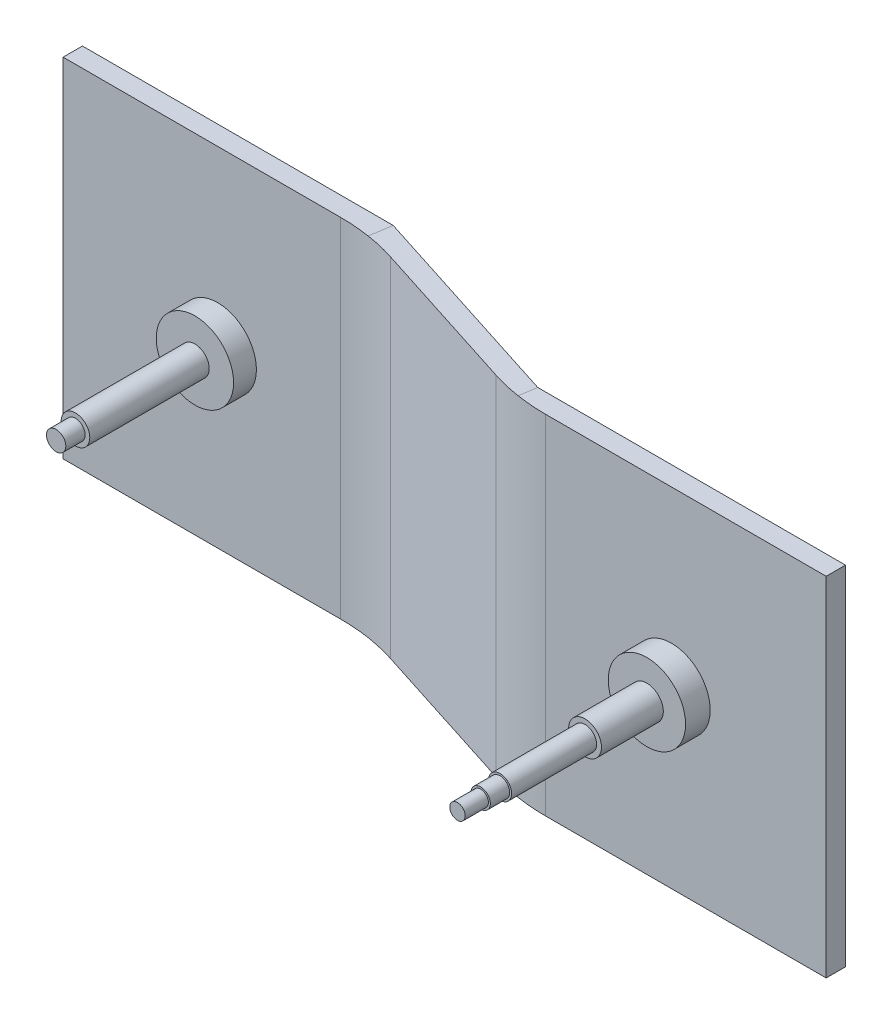
ISO-10303-21;
HEADER;
FILE_DESCRIPTION(('STEP AP214'),'2;1');
FILE_NAME('part.step','',(''),(''),'','','');
FILE_SCHEMA(('AUTOMOTIVE_DESIGN { 1 0 10303 214 1 1 1 1 }'));
ENDSEC;
DATA;
#1=APPLICATION_CONTEXT('core data for automotive mechanical design processes');
#2=APPLICATION_PROTOCOL_DEFINITION('international standard','automotive_design',2000,#1);
#3=PRODUCT_CONTEXT('',#1,'mechanical');
#4=PRODUCT('Part','Part','',(#3));
#5=PRODUCT_RELATED_PRODUCT_CATEGORY('part','',(#4));
#6=PRODUCT_DEFINITION_FORMATION('','',#4);
#7=PRODUCT_DEFINITION_CONTEXT('part definition',#1,'design');
#8=PRODUCT_DEFINITION('design','',#6,#7);
#9=PRODUCT_DEFINITION_SHAPE('','',#8);
#10=(LENGTH_UNIT() NAMED_UNIT(*) SI_UNIT(.MILLI.,.METRE.));
#11=(NAMED_UNIT(*) PLANE_ANGLE_UNIT() SI_UNIT($,.RADIAN.));
#12=(NAMED_UNIT(*) SI_UNIT($,.STERADIAN.) SOLID_ANGLE_UNIT());
#13=UNCERTAINTY_MEASURE_WITH_UNIT(LENGTH_MEASURE(1.E-05),#10,'distance_accuracy_value','');
#14=(GEOMETRIC_REPRESENTATION_CONTEXT(3) GLOBAL_UNCERTAINTY_ASSIGNED_CONTEXT((#13)) GLOBAL_UNIT_ASSIGNED_CONTEXT((#10,
#11,#12)) REPRESENTATION_CONTEXT('',''));
#15=CARTESIAN_POINT('',(0.,0.,0.));
#16=DIRECTION('',(0.,0.,1.));
#17=DIRECTION('',(1.,0.,0.));
#18=AXIS2_PLACEMENT_3D('',#15,#16,#17);
#19=CARTESIAN_POINT('',(-350.,0.,-35.20194684));
#20=DIRECTION('',(1.,0.,0.));
#21=DIRECTION('',(0.,0.,-1.));
#22=AXIS2_PLACEMENT_3D('',#19,#20,#21);
#23=PLANE('',#22);
#24=DIRECTION('',(0.,-1.,0.));
#25=VECTOR('',#24,1.);
#26=CARTESIAN_POINT('',(-350.,90.,-30.20194684));
#27=LINE('',#26,#25);
#28=CARTESIAN_POINT('',(-350.,90.,-30.20194684));
#29=VERTEX_POINT('',#28);
#30=CARTESIAN_POINT('',(-350.,-90.,-30.20194684));
#31=VERTEX_POINT('',#30);
#32=EDGE_CURVE('E182',#29,#31,#27,.T.);
#33=ORIENTED_EDGE('',*,*,#32,.F.);
#34=DIRECTION('',(0.,0.,1.));
#35=VECTOR('',#34,1.);
#36=CARTESIAN_POINT('',(-350.,90.,-30.20194684));
#37=LINE('',#36,#35);
#38=CARTESIAN_POINT('',(-350.,90.,-40.20194684));
#39=VERTEX_POINT('',#38);
#40=EDGE_CURVE('E174',#39,#29,#37,.T.);
#41=ORIENTED_EDGE('',*,*,#40,.F.);
#42=DIRECTION('',(0.,1.,0.));
#43=VECTOR('',#42,1.);
#44=CARTESIAN_POINT('',(-350.,90.,-40.20194684));
#45=LINE('',#44,#43);
#46=CARTESIAN_POINT('',(-350.,-90.,-40.20194684));
#47=VERTEX_POINT('',#46);
#48=EDGE_CURVE('E177',#47,#39,#45,.T.);
#49=ORIENTED_EDGE('',*,*,#48,.F.);
#50=DIRECTION('',(0.,0.,-1.));
#51=VECTOR('',#50,1.);
#52=CARTESIAN_POINT('',(-350.,-90.,-30.20194684));
#53=LINE('',#52,#51);
#54=EDGE_CURVE('E180',#31,#47,#53,.T.);
#55=ORIENTED_EDGE('',*,*,#54,.F.);
#56=EDGE_LOOP('',(#33,#41,#49,#55));
#57=FACE_BOUND('',#56,.T.);
#58=ADVANCED_FACE('F32',(#57),#23,.F.);
#59=CARTESIAN_POINT('',(80.,0.,0.));
#60=DIRECTION('',(1.,0.,0.));
#61=DIRECTION('',(0.,0.,-1.));
#62=AXIS2_PLACEMENT_3D('',#59,#60,#61);
#63=PLANE('',#62);
#64=DIRECTION('',(0.,-1.,0.));
#65=VECTOR('',#64,1.);
#66=CARTESIAN_POINT('',(80.,90.,5.00000000000002));
#67=LINE('',#66,#65);
#68=CARTESIAN_POINT('',(80.,90.,5.00000000000002));
#69=VERTEX_POINT('',#68);
#70=CARTESIAN_POINT('',(80.,-90.,4.99999999999998));
#71=VERTEX_POINT('',#70);
#72=EDGE_CURVE('E122',#69,#71,#67,.T.);
#73=ORIENTED_EDGE('',*,*,#72,.T.);
#74=DIRECTION('',(0.,0.,-1.));
#75=VECTOR('',#74,1.);
#76=CARTESIAN_POINT('',(80.,-90.,4.99999999999998));
#77=LINE('',#76,#75);
#78=CARTESIAN_POINT('',(80.,-90.,-4.99999999999998));
#79=VERTEX_POINT('',#78);
#80=EDGE_CURVE('E132',#71,#79,#77,.T.);
#81=ORIENTED_EDGE('',*,*,#80,.T.);
#82=DIRECTION('',(0.,1.,0.));
#83=VECTOR('',#82,1.);
#84=CARTESIAN_POINT('',(80.,90.,-4.99999999999998));
#85=LINE('',#84,#83);
#86=CARTESIAN_POINT('',(80.,90.,-4.99999999999998));
#87=VERTEX_POINT('',#86);
#88=EDGE_CURVE('E137',#79,#87,#85,.T.);
#89=ORIENTED_EDGE('',*,*,#88,.T.);
#90=DIRECTION('',(0.,0.,1.));
#91=VECTOR('',#90,1.);
#92=CARTESIAN_POINT('',(80.,90.,5.00000000000002));
#93=LINE('',#92,#91);
#94=EDGE_CURVE('E135',#87,#69,#93,.T.);
#95=ORIENTED_EDGE('',*,*,#94,.T.);
#96=EDGE_LOOP('',(#73,#81,#89,#95));
#97=FACE_BOUND('',#96,.T.);
#98=ADVANCED_FACE('F136',(#97),#63,.T.);
#99=CARTESIAN_POINT('',(-189.041398245251,90.,-30.20194684));
#100=DIRECTION('',(0.,0.,-1.));
#101=DIRECTION('',(0.,1.,0.));
#102=AXIS2_PLACEMENT_3D('',#99,#100,#101);
#103=PLANE('',#102);
#104=CARTESIAN_POINT('',(-270.,0.,-30.20194684));
#105=DIRECTION('',(0.,0.,-1.));
#106=DIRECTION('',(0.,1.,0.));
#107=AXIS2_PLACEMENT_3D('',#104,#105,#106);
#108=CIRCLE('',#107,20.);
#109=CARTESIAN_POINT('',(-270.,20.,-30.20194684));
#110=VERTEX_POINT('',#109);
#111=EDGE_CURVE('E194',#110,#110,#108,.F.);
#112=ORIENTED_EDGE('',*,*,#111,.F.);
#113=EDGE_LOOP('',(#112));
#114=FACE_BOUND('',#113,.T.);
#115=DIRECTION('',(-1.,0.,0.));
#116=VECTOR('',#115,1.);
#117=CARTESIAN_POINT('',(-189.041398245251,-90.,-30.20194684));
#118=LINE('',#117,#116);
#119=CARTESIAN_POINT('',(-206.391488045215,-90.,-30.20194684));
#120=VERTEX_POINT('',#119);
#121=EDGE_CURVE('E191',#120,#31,#118,.T.);
#122=ORIENTED_EDGE('',*,*,#121,.F.);
#123=DIRECTION('',(0.,1.,0.));
#124=VECTOR('',#123,1.);
#125=CARTESIAN_POINT('',(-206.391488045215,90.,-30.20194684));
#126=LINE('',#125,#124);
#127=CARTESIAN_POINT('',(-206.391488045215,90.,-30.20194684));
#128=VERTEX_POINT('',#127);
#129=EDGE_CURVE('E214',#120,#128,#126,.T.);
#130=ORIENTED_EDGE('',*,*,#129,.T.);
#131=DIRECTION('',(-1.,0.,0.));
#132=VECTOR('',#131,1.);
#133=CARTESIAN_POINT('',(-189.041398245251,90.,-30.20194684));
#134=LINE('',#133,#132);
#135=EDGE_CURVE('E166',#128,#29,#134,.T.);
#136=ORIENTED_EDGE('',*,*,#135,.T.);
#137=ORIENTED_EDGE('',*,*,#32,.T.);
#138=EDGE_LOOP('',(#122,#130,#136,#137));
#139=FACE_BOUND('',#138,.T.);
#140=ADVANCED_FACE('F233',(#114,#139),#103,.F.);
#141=CARTESIAN_POINT('',(-189.041398245251,-90.,-30.20194684));
#142=DIRECTION('',(0.,1.,0.));
#143=DIRECTION('',(0.,0.,1.));
#144=AXIS2_PLACEMENT_3D('',#141,#142,#143);
#145=PLANE('',#144);
#146=DIRECTION('',(-0.15424128166296,0.,0.988033211502006));
#147=VECTOR('',#146,1.);
#148=CARTESIAN_POINT('',(-193.532460612832,-90.,-12.5738386826287));
#149=LINE('',#148,#147);
#150=CARTESIAN_POINT('',(-189.219452950228,-90.,-40.20194684));
#151=VERTEX_POINT('',#150);
#152=CARTESIAN_POINT('',(-190.967359878919,-90.,-29.0052679902006));
#153=VERTEX_POINT('',#152);
#154=EDGE_CURVE('E46',#151,#153,#149,.T.);
#155=ORIENTED_EDGE('',*,*,#154,.T.);
#156=CARTESIAN_POINT('',(-206.391488045215,-90.,69.79805316));
#157=DIRECTION('',(0.,1.,0.));
#158=DIRECTION('',(0.,0.,1.));
#159=AXIS2_PLACEMENT_3D('',#156,#157,#158);
#160=CIRCLE('',#159,100.);
#161=EDGE_CURVE('E11',#153,#120,#160,.T.);
#162=ORIENTED_EDGE('',*,*,#161,.T.);
#163=ORIENTED_EDGE('',*,*,#121,.T.);
#164=ORIENTED_EDGE('',*,*,#54,.T.);
#165=DIRECTION('',(-1.,0.,0.));
#166=VECTOR('',#165,1.);
#167=CARTESIAN_POINT('',(-189.041398245251,-90.,-40.20194684));
#168=LINE('',#167,#166);
#169=EDGE_CURVE('E188',#151,#47,#168,.T.);
#170=ORIENTED_EDGE('',*,*,#169,.F.);
#171=EDGE_LOOP('',(#155,#162,#163,#164,#170));
#172=FACE_BOUND('',#171,.T.);
#173=ADVANCED_FACE('F231',(#172),#145,.F.);
#174=CARTESIAN_POINT('',(-189.041398245251,90.,-40.20194684));
#175=DIRECTION('',(0.,0.,1.));
#176=DIRECTION('',(1.,0.,0.));
#177=AXIS2_PLACEMENT_3D('',#174,#175,#176);
#178=PLANE('',#177);
#179=DIRECTION('',(0.,-1.,0.));
#180=VECTOR('',#179,1.);
#181=CARTESIAN_POINT('',(-189.219452950228,90.,-40.20194684));
#182=LINE('',#181,#180);
#183=CARTESIAN_POINT('',(-189.219452950228,90.,-40.20194684));
#184=VERTEX_POINT('',#183);
#185=EDGE_CURVE('E158',#184,#151,#182,.T.);
#186=ORIENTED_EDGE('',*,*,#185,.T.);
#187=ORIENTED_EDGE('',*,*,#169,.T.);
#188=ORIENTED_EDGE('',*,*,#48,.T.);
#189=DIRECTION('',(-1.,0.,0.));
#190=VECTOR('',#189,1.);
#191=CARTESIAN_POINT('',(-189.041398245251,90.,-40.20194684));
#192=LINE('',#191,#190);
#193=EDGE_CURVE('E185',#184,#39,#192,.T.);
#194=ORIENTED_EDGE('',*,*,#193,.F.);
#195=EDGE_LOOP('',(#186,#187,#188,#194));
#196=FACE_BOUND('',#195,.T.);
#197=ADVANCED_FACE('F242',(#196),#178,.F.);
#198=CARTESIAN_POINT('',(-189.041398245251,90.,-30.20194684));
#199=DIRECTION('',(0.,-1.,0.));
#200=DIRECTION('',(0.,0.,-1.));
#201=AXIS2_PLACEMENT_3D('',#198,#199,#200);
#202=PLANE('',#201);
#203=DIRECTION('',(0.15424128166296,0.,-0.988033211502006));
#204=VECTOR('',#203,1.);
#205=CARTESIAN_POINT('',(-193.532460612832,90.,-12.5738386826287));
#206=LINE('',#205,#204);
#207=CARTESIAN_POINT('',(-190.967359878919,90.,-29.0052679902006));
#208=VERTEX_POINT('',#207);
#209=EDGE_CURVE('E54',#208,#184,#206,.T.);
#210=ORIENTED_EDGE('',*,*,#209,.T.);
#211=ORIENTED_EDGE('',*,*,#193,.T.);
#212=ORIENTED_EDGE('',*,*,#40,.T.);
#213=ORIENTED_EDGE('',*,*,#135,.F.);
#214=CARTESIAN_POINT('',(-206.391488045215,90.,69.79805316));
#215=DIRECTION('',(0.,-1.,0.));
#216=DIRECTION('',(0.,0.,-1.));
#217=AXIS2_PLACEMENT_3D('',#214,#215,#216);
#218=CIRCLE('',#217,100.);
#219=EDGE_CURVE('E217',#128,#208,#218,.T.);
#220=ORIENTED_EDGE('',*,*,#219,.T.);
#221=EDGE_LOOP('',(#210,#211,#212,#213,#220));
#222=FACE_BOUND('',#221,.T.);
#223=ADVANCED_FACE('F265',(#222),#202,.F.);
#224=CARTESIAN_POINT('',(-80.6109643204755,90.,5.05426947474259));
#225=DIRECTION('',(0.,-1.,0.));
#226=DIRECTION('',(0.,0.,-1.));
#227=AXIS2_PLACEMENT_3D('',#224,#225,#226);
#228=PLANE('',#227);
#229=DIRECTION('',(-0.952419254061935,0.,-0.304791017735279));
#230=VECTOR('',#229,1.);
#231=CARTESIAN_POINT('',(-80.6109643204755,90.,5.05426947474259));
#232=LINE('',#231,#230);
#233=CARTESIAN_POINT('',(-95.6487078278569,90.,0.241925406193542));
#234=VERTEX_POINT('',#233);
#235=CARTESIAN_POINT('',(-175.912386271687,90.,-25.4438722461935));
#236=VERTEX_POINT('',#235);
#237=EDGE_CURVE('E162',#234,#236,#232,.T.);
#238=ORIENTED_EDGE('',*,*,#237,.F.);
#239=CARTESIAN_POINT('',(-65.169606054329,90.,-95.));
#240=DIRECTION('',(0.,-1.,0.));
#241=DIRECTION('',(0.,0.,-1.));
#242=AXIS2_PLACEMENT_3D('',#239,#240,#241);
#243=CIRCLE('',#242,100.);
#244=CARTESIAN_POINT('',(-80.593734220625,90.,3.8033211502006));
#245=VERTEX_POINT('',#244);
#246=EDGE_CURVE('E205',#234,#245,#243,.F.);
#247=ORIENTED_EDGE('',*,*,#246,.T.);
#248=DIRECTION('',(0.15424128166296,0.,-0.988033211502006));
#249=VECTOR('',#248,1.);
#250=CARTESIAN_POINT('',(-76.955517869293,90.,-19.5022332836675));
#251=LINE('',#250,#249);
#252=CARTESIAN_POINT('',(-79.2194529502278,90.,-4.99999999999998));
#253=VERTEX_POINT('',#252);
#254=EDGE_CURVE('E155',#245,#253,#251,.T.);
#255=ORIENTED_EDGE('',*,*,#254,.T.);
#256=DIRECTION('',(-0.952419254061935,0.,-0.304791017735279));
#257=VECTOR('',#256,1.);
#258=CARTESIAN_POINT('',(-77.5630541431227,90.,-4.46992306587676));
#259=LINE('',#258,#257);
#260=EDGE_CURVE('E163',#253,#184,#259,.T.);
#261=ORIENTED_EDGE('',*,*,#260,.T.);
#262=ORIENTED_EDGE('',*,*,#209,.F.);
#263=CARTESIAN_POINT('',(-206.391488045215,90.,69.79805316));
#264=DIRECTION('',(0.,-1.,0.));
#265=DIRECTION('',(0.,0.,-1.));
#266=AXIS2_PLACEMENT_3D('',#263,#264,#265);
#267=CIRCLE('',#266,100.);
#268=EDGE_CURVE('E219',#208,#236,#267,.T.);
#269=ORIENTED_EDGE('',*,*,#268,.T.);
#270=EDGE_LOOP('',(#238,#247,#255,#261,#262,#269));
#271=FACE_BOUND('',#270,.T.);
#272=ADVANCED_FACE('F262',(#271),#228,.F.);
#273=CARTESIAN_POINT('',(-77.5630541431227,90.,-4.46992306587676));
#274=DIRECTION('',(-0.304791017735279,0.,0.952419254061935));
#275=DIRECTION('',(0.952419254061935,0.,0.304791017735279));
#276=AXIS2_PLACEMENT_3D('',#273,#274,#275);
#277=PLANE('',#276);
#278=ORIENTED_EDGE('',*,*,#260,.F.);
#279=DIRECTION('',(0.,-1.,0.));
#280=VECTOR('',#279,1.);
#281=CARTESIAN_POINT('',(-79.2194529502278,90.,-4.99999999999998));
#282=LINE('',#281,#280);
#283=CARTESIAN_POINT('',(-79.2194529502278,-90.,-4.99999999999998));
#284=VERTEX_POINT('',#283);
#285=EDGE_CURVE('E248',#253,#284,#282,.T.);
#286=ORIENTED_EDGE('',*,*,#285,.T.);
#287=DIRECTION('',(-0.952419254061935,0.,-0.304791017735279));
#288=VECTOR('',#287,1.);
#289=CARTESIAN_POINT('',(-77.5630541431227,-90.,-4.46992306587676));
#290=LINE('',#289,#288);
#291=EDGE_CURVE('E165',#284,#151,#290,.T.);
#292=ORIENTED_EDGE('',*,*,#291,.T.);
#293=ORIENTED_EDGE('',*,*,#185,.F.);
#294=EDGE_LOOP('',(#278,#286,#292,#293));
#295=FACE_BOUND('',#294,.T.);
#296=ADVANCED_FACE('F246',(#295),#277,.F.);
#297=CARTESIAN_POINT('',(-80.6109643204755,-90.,5.05426947474255));
#298=DIRECTION('',(0.,1.,0.));
#299=DIRECTION('',(0.,0.,1.));
#300=AXIS2_PLACEMENT_3D('',#297,#298,#299);
#301=PLANE('',#300);
#302=DIRECTION('',(-0.15424128166296,0.,0.988033211502006));
#303=VECTOR('',#302,1.);
#304=CARTESIAN_POINT('',(-76.955517869293,-90.,-19.5022332836675));
#305=LINE('',#304,#303);
#306=CARTESIAN_POINT('',(-80.593734220625,-90.,3.80332115020056));
#307=VERTEX_POINT('',#306);
#308=EDGE_CURVE('E249',#284,#307,#305,.T.);
#309=ORIENTED_EDGE('',*,*,#308,.T.);
#310=CARTESIAN_POINT('',(-65.169606054329,-90.,-95.));
#311=DIRECTION('',(0.,1.,0.));
#312=DIRECTION('',(0.,0.,1.));
#313=AXIS2_PLACEMENT_3D('',#310,#311,#312);
#314=CIRCLE('',#313,100.);
#315=CARTESIAN_POINT('',(-95.6487078278569,-90.,0.241925406193497));
#316=VERTEX_POINT('',#315);
#317=EDGE_CURVE('E212',#307,#316,#314,.F.);
#318=ORIENTED_EDGE('',*,*,#317,.T.);
#319=DIRECTION('',(-0.952419254061935,0.,-0.304791017735279));
#320=VECTOR('',#319,1.);
#321=CARTESIAN_POINT('',(-80.6109643204755,-90.,5.05426947474255));
#322=LINE('',#321,#320);
#323=CARTESIAN_POINT('',(-175.912386271687,-90.,-25.4438722461936));
#324=VERTEX_POINT('',#323);
#325=EDGE_CURVE('E169',#316,#324,#322,.T.);
#326=ORIENTED_EDGE('',*,*,#325,.T.);
#327=CARTESIAN_POINT('',(-206.391488045215,-90.,69.79805316));
#328=DIRECTION('',(0.,1.,0.));
#329=DIRECTION('',(0.,0.,1.));
#330=AXIS2_PLACEMENT_3D('',#327,#328,#329);
#331=CIRCLE('',#330,100.);
#332=EDGE_CURVE('E40',#324,#153,#331,.T.);
#333=ORIENTED_EDGE('',*,*,#332,.T.);
#334=ORIENTED_EDGE('',*,*,#154,.F.);
#335=ORIENTED_EDGE('',*,*,#291,.F.);
#336=EDGE_LOOP('',(#309,#318,#326,#333,#334,#335));
#337=FACE_BOUND('',#336,.T.);
#338=ADVANCED_FACE('F224',(#337),#301,.F.);
#339=CARTESIAN_POINT('',(-80.6109643204755,90.,5.05426947474259));
#340=DIRECTION('',(0.304791017735279,0.,-0.952419254061935));
#341=DIRECTION('',(-0.952419254061935,0.,-0.304791017735279));
#342=AXIS2_PLACEMENT_3D('',#339,#340,#341);
#343=PLANE('',#342);
#344=ORIENTED_EDGE('',*,*,#325,.F.);
#345=DIRECTION('',(0.,1.,0.));
#346=VECTOR('',#345,1.);
#347=CARTESIAN_POINT('',(-95.6487078278569,90.,0.241925406193542));
#348=LINE('',#347,#346);
#349=EDGE_CURVE('E201',#316,#234,#348,.T.);
#350=ORIENTED_EDGE('',*,*,#349,.T.);
#351=ORIENTED_EDGE('',*,*,#237,.T.);
#352=DIRECTION('',(0.,1.,0.));
#353=VECTOR('',#352,1.);
#354=CARTESIAN_POINT('',(-175.912386271687,-90.,-25.4438722461936));
#355=LINE('',#354,#353);
#356=EDGE_CURVE('E199',#236,#324,#355,.F.);
#357=ORIENTED_EDGE('',*,*,#356,.T.);
#358=EDGE_LOOP('',(#344,#350,#351,#357));
#359=FACE_BOUND('',#358,.T.);
#360=ADVANCED_FACE('F261',(#359),#343,.F.);
#361=CARTESIAN_POINT('',(80.,90.,5.00000000000002));
#362=DIRECTION('',(0.,-1.,0.));
#363=DIRECTION('',(0.,0.,-1.));
#364=AXIS2_PLACEMENT_3D('',#361,#362,#363);
#365=PLANE('',#364);
#366=ORIENTED_EDGE('',*,*,#254,.F.);
#367=CARTESIAN_POINT('',(-65.169606054329,90.,-95.));
#368=DIRECTION('',(0.,-1.,0.));
#369=DIRECTION('',(0.,0.,-1.));
#370=AXIS2_PLACEMENT_3D('',#367,#368,#369);
#371=CIRCLE('',#370,100.);
#372=CARTESIAN_POINT('',(-65.169606054329,90.,5.00000000000002));
#373=VERTEX_POINT('',#372);
#374=EDGE_CURVE('E145',#245,#373,#371,.F.);
#375=ORIENTED_EDGE('',*,*,#374,.T.);
#376=DIRECTION('',(-1.,0.,0.));
#377=VECTOR('',#376,1.);
#378=CARTESIAN_POINT('',(80.,90.,5.00000000000002));
#379=LINE('',#378,#377);
#380=EDGE_CURVE('E126',#69,#373,#379,.T.);
#381=ORIENTED_EDGE('',*,*,#380,.F.);
#382=ORIENTED_EDGE('',*,*,#94,.F.);
#383=DIRECTION('',(-1.,0.,0.));
#384=VECTOR('',#383,1.);
#385=CARTESIAN_POINT('',(80.,90.,-4.99999999999998));
#386=LINE('',#385,#384);
#387=EDGE_CURVE('E153',#87,#253,#386,.T.);
#388=ORIENTED_EDGE('',*,*,#387,.T.);
#389=EDGE_LOOP('',(#366,#375,#381,#382,#388));
#390=FACE_BOUND('',#389,.T.);
#391=ADVANCED_FACE('F143',(#390),#365,.F.);
#392=CARTESIAN_POINT('',(80.,90.,-4.99999999999998));
#393=DIRECTION('',(0.,0.,1.));
#394=DIRECTION('',(1.,0.,0.));
#395=AXIS2_PLACEMENT_3D('',#392,#393,#394);
#396=PLANE('',#395);
#397=ORIENTED_EDGE('',*,*,#387,.F.);
#398=ORIENTED_EDGE('',*,*,#88,.F.);
#399=DIRECTION('',(-1.,0.,0.));
#400=VECTOR('',#399,1.);
#401=CARTESIAN_POINT('',(80.,-90.,-4.99999999999998));
#402=LINE('',#401,#400);
#403=EDGE_CURVE('E147',#79,#284,#402,.T.);
#404=ORIENTED_EDGE('',*,*,#403,.T.);
#405=ORIENTED_EDGE('',*,*,#285,.F.);
#406=EDGE_LOOP('',(#397,#398,#404,#405));
#407=FACE_BOUND('',#406,.T.);
#408=ADVANCED_FACE('F267',(#407),#396,.F.);
#409=CARTESIAN_POINT('',(80.,-90.,4.99999999999998));
#410=DIRECTION('',(0.,1.,0.));
#411=DIRECTION('',(0.,0.,1.));
#412=AXIS2_PLACEMENT_3D('',#409,#410,#411);
#413=PLANE('',#412);
#414=DIRECTION('',(-1.,0.,0.));
#415=VECTOR('',#414,1.);
#416=CARTESIAN_POINT('',(80.,-90.,4.99999999999998));
#417=LINE('',#416,#415);
#418=CARTESIAN_POINT('',(-65.169606054329,-90.,4.99999999999998));
#419=VERTEX_POINT('',#418);
#420=EDGE_CURVE('E129',#71,#419,#417,.T.);
#421=ORIENTED_EDGE('',*,*,#420,.T.);
#422=CARTESIAN_POINT('',(-65.169606054329,-90.,-95.));
#423=DIRECTION('',(0.,1.,0.));
#424=DIRECTION('',(0.,0.,1.));
#425=AXIS2_PLACEMENT_3D('',#422,#423,#424);
#426=CIRCLE('',#425,100.);
#427=EDGE_CURVE('E210',#419,#307,#426,.F.);
#428=ORIENTED_EDGE('',*,*,#427,.T.);
#429=ORIENTED_EDGE('',*,*,#308,.F.);
#430=ORIENTED_EDGE('',*,*,#403,.F.);
#431=ORIENTED_EDGE('',*,*,#80,.F.);
#432=EDGE_LOOP('',(#421,#428,#429,#430,#431));
#433=FACE_BOUND('',#432,.T.);
#434=ADVANCED_FACE('F357',(#433),#413,.F.);
#435=CARTESIAN_POINT('',(80.,90.,5.00000000000002));
#436=DIRECTION('',(0.,0.,-1.));
#437=DIRECTION('',(0.,1.,0.));
#438=AXIS2_PLACEMENT_3D('',#435,#436,#437);
#439=PLANE('',#438);
#440=CARTESIAN_POINT('',(0.,0.,5.));
#441=DIRECTION('',(0.,0.,1.));
#442=DIRECTION('',(1.,0.,0.));
#443=AXIS2_PLACEMENT_3D('',#440,#441,#442);
#444=CIRCLE('',#443,20.);
#445=CARTESIAN_POINT('',(20.,0.,5.));
#446=VERTEX_POINT('',#445);
#447=EDGE_CURVE('E253',#446,#446,#444,.T.);
#448=ORIENTED_EDGE('',*,*,#447,.F.);
#449=EDGE_LOOP('',(#448));
#450=FACE_BOUND('',#449,.T.);
#451=ORIENTED_EDGE('',*,*,#380,.T.);
#452=DIRECTION('',(0.,1.,0.));
#453=VECTOR('',#452,1.);
#454=CARTESIAN_POINT('',(-65.169606054329,90.,5.00000000000002));
#455=LINE('',#454,#453);
#456=EDGE_CURVE('E208',#373,#419,#455,.F.);
#457=ORIENTED_EDGE('',*,*,#456,.T.);
#458=ORIENTED_EDGE('',*,*,#420,.F.);
#459=ORIENTED_EDGE('',*,*,#72,.F.);
#460=EDGE_LOOP('',(#451,#457,#458,#459));
#461=FACE_BOUND('',#460,.T.);
#462=ADVANCED_FACE('F124',(#450,#461),#439,.F.);
#463=CARTESIAN_POINT('',(0.,0.,17.75569081));
#464=DIRECTION('',(0.,0.,-1.));
#465=DIRECTION('',(-1.,0.,0.));
#466=AXIS2_PLACEMENT_3D('',#463,#464,#465);
#467=CYLINDRICAL_SURFACE('',#466,20.);
#468=CARTESIAN_POINT('',(0.,0.,17.75569081));
#469=DIRECTION('',(0.,0.,1.));
#470=DIRECTION('',(1.,0.,0.));
#471=AXIS2_PLACEMENT_3D('',#468,#469,#470);
#472=CIRCLE('',#471,20.);
#473=CARTESIAN_POINT('',(20.,0.,17.75569081));
#474=VERTEX_POINT('',#473);
#475=EDGE_CURVE('E178',#474,#474,#472,.T.);
#476=ORIENTED_EDGE('',*,*,#475,.F.);
#477=EDGE_LOOP('',(#476));
#478=FACE_BOUND('',#477,.T.);
#479=ORIENTED_EDGE('',*,*,#447,.T.);
#480=EDGE_LOOP('',(#479));
#481=FACE_BOUND('',#480,.T.);
#482=ADVANCED_FACE('F356',(#478,#481),#467,.T.);
#483=CARTESIAN_POINT('',(0.,0.,17.75569081));
#484=DIRECTION('',(0.,0.,1.));
#485=DIRECTION('',(1.,0.,0.));
#486=AXIS2_PLACEMENT_3D('',#483,#484,#485);
#487=PLANE('',#486);
#488=CARTESIAN_POINT('',(0.,0.,17.75569081));
#489=DIRECTION('',(0.,0.,1.));
#490=DIRECTION('',(1.,0.,0.));
#491=AXIS2_PLACEMENT_3D('',#488,#489,#490);
#492=CIRCLE('',#491,8.5);
#493=CARTESIAN_POINT('',(8.5,0.,17.75569081));
#494=VERTEX_POINT('',#493);
#495=EDGE_CURVE('E273',#494,#494,#492,.T.);
#496=ORIENTED_EDGE('',*,*,#495,.F.);
#497=EDGE_LOOP('',(#496));
#498=FACE_BOUND('',#497,.T.);
#499=ORIENTED_EDGE('',*,*,#475,.T.);
#500=EDGE_LOOP('',(#499));
#501=FACE_BOUND('',#500,.T.);
#502=ADVANCED_FACE('F365',(#498,#501),#487,.T.);
#503=CARTESIAN_POINT('',(0.,0.,49.75569081));
#504=DIRECTION('',(0.,0.,-1.));
#505=DIRECTION('',(-1.,0.,0.));
#506=AXIS2_PLACEMENT_3D('',#503,#504,#505);
#507=CYLINDRICAL_SURFACE('',#506,8.5);
#508=CARTESIAN_POINT('',(0.,0.,49.75569081));
#509=DIRECTION('',(0.,0.,1.));
#510=DIRECTION('',(1.,0.,0.));
#511=AXIS2_PLACEMENT_3D('',#508,#509,#510);
#512=CIRCLE('',#511,8.5);
#513=CARTESIAN_POINT('',(8.5,0.,49.75569081));
#514=VERTEX_POINT('',#513);
#515=EDGE_CURVE('E276',#514,#514,#512,.T.);
#516=ORIENTED_EDGE('',*,*,#515,.F.);
#517=EDGE_LOOP('',(#516));
#518=FACE_BOUND('',#517,.T.);
#519=ORIENTED_EDGE('',*,*,#495,.T.);
#520=EDGE_LOOP('',(#519));
#521=FACE_BOUND('',#520,.T.);
#522=ADVANCED_FACE('F425',(#518,#521),#507,.T.);
#523=CARTESIAN_POINT('',(0.,0.,49.75569081));
#524=DIRECTION('',(0.,0.,1.));
#525=DIRECTION('',(1.,0.,0.));
#526=AXIS2_PLACEMENT_3D('',#523,#524,#525);
#527=PLANE('',#526);
#528=CARTESIAN_POINT('',(0.,0.,49.75569081));
#529=DIRECTION('',(0.,0.,1.));
#530=DIRECTION('',(1.,0.,0.));
#531=AXIS2_PLACEMENT_3D('',#528,#529,#530);
#532=CIRCLE('',#531,6.);
#533=CARTESIAN_POINT('',(6.,0.,49.75569081));
#534=VERTEX_POINT('',#533);
#535=EDGE_CURVE('E279',#534,#534,#532,.T.);
#536=ORIENTED_EDGE('',*,*,#535,.F.);
#537=EDGE_LOOP('',(#536));
#538=FACE_BOUND('',#537,.T.);
#539=ORIENTED_EDGE('',*,*,#515,.T.);
#540=EDGE_LOOP('',(#539));
#541=FACE_BOUND('',#540,.T.);
#542=ADVANCED_FACE('F421',(#538,#541),#527,.T.);
#543=CARTESIAN_POINT('',(0.,0.,93.75569081));
#544=DIRECTION('',(0.,0.,-1.));
#545=DIRECTION('',(-1.,0.,0.));
#546=AXIS2_PLACEMENT_3D('',#543,#544,#545);
#547=CYLINDRICAL_SURFACE('',#546,6.);
#548=CARTESIAN_POINT('',(0.,0.,93.75569081));
#549=DIRECTION('',(0.,0.,1.));
#550=DIRECTION('',(1.,0.,0.));
#551=AXIS2_PLACEMENT_3D('',#548,#549,#550);
#552=CIRCLE('',#551,6.);
#553=CARTESIAN_POINT('',(6.,0.,93.75569081));
#554=VERTEX_POINT('',#553);
#555=EDGE_CURVE('E282',#554,#554,#552,.T.);
#556=ORIENTED_EDGE('',*,*,#555,.F.);
#557=EDGE_LOOP('',(#556));
#558=FACE_BOUND('',#557,.T.);
#559=ORIENTED_EDGE('',*,*,#535,.T.);
#560=EDGE_LOOP('',(#559));
#561=FACE_BOUND('',#560,.T.);
#562=ADVANCED_FACE('F417',(#558,#561),#547,.T.);
#563=CARTESIAN_POINT('',(0.,0.,93.75569081));
#564=DIRECTION('',(0.,0.,1.));
#565=DIRECTION('',(1.,0.,0.));
#566=AXIS2_PLACEMENT_3D('',#563,#564,#565);
#567=PLANE('',#566);
#568=CARTESIAN_POINT('',(0.,0.,93.75569081));
#569=DIRECTION('',(0.,0.,1.));
#570=DIRECTION('',(1.,0.,0.));
#571=AXIS2_PLACEMENT_3D('',#568,#569,#570);
#572=CIRCLE('',#571,5.);
#573=CARTESIAN_POINT('',(5.,0.,93.75569081));
#574=VERTEX_POINT('',#573);
#575=EDGE_CURVE('E285',#574,#574,#572,.T.);
#576=ORIENTED_EDGE('',*,*,#575,.F.);
#577=EDGE_LOOP('',(#576));
#578=FACE_BOUND('',#577,.T.);
#579=ORIENTED_EDGE('',*,*,#555,.T.);
#580=EDGE_LOOP('',(#579));
#581=FACE_BOUND('',#580,.T.);
#582=ADVANCED_FACE('F413',(#578,#581),#567,.T.);
#583=CARTESIAN_POINT('',(0.,0.,103.75569081));
#584=DIRECTION('',(0.,0.,-1.));
#585=DIRECTION('',(-1.,0.,0.));
#586=AXIS2_PLACEMENT_3D('',#583,#584,#585);
#587=CYLINDRICAL_SURFACE('',#586,5.);
#588=CARTESIAN_POINT('',(0.,0.,103.75569081));
#589=DIRECTION('',(0.,0.,1.));
#590=DIRECTION('',(1.,0.,0.));
#591=AXIS2_PLACEMENT_3D('',#588,#589,#590);
#592=CIRCLE('',#591,5.);
#593=CARTESIAN_POINT('',(5.,0.,103.75569081));
#594=VERTEX_POINT('',#593);
#595=EDGE_CURVE('E288',#594,#594,#592,.T.);
#596=ORIENTED_EDGE('',*,*,#595,.F.);
#597=EDGE_LOOP('',(#596));
#598=FACE_BOUND('',#597,.T.);
#599=ORIENTED_EDGE('',*,*,#575,.T.);
#600=EDGE_LOOP('',(#599));
#601=FACE_BOUND('',#600,.T.);
#602=ADVANCED_FACE('F409',(#598,#601),#587,.T.);
#603=CARTESIAN_POINT('',(0.,0.,103.75569081));
#604=DIRECTION('',(0.,0.,1.));
#605=DIRECTION('',(1.,0.,0.));
#606=AXIS2_PLACEMENT_3D('',#603,#604,#605);
#607=PLANE('',#606);
#608=CARTESIAN_POINT('',(0.,0.,103.75569081));
#609=DIRECTION('',(0.,0.,1.));
#610=DIRECTION('',(1.,0.,0.));
#611=AXIS2_PLACEMENT_3D('',#608,#609,#610);
#612=CIRCLE('',#611,4.);
#613=CARTESIAN_POINT('',(4.,0.,103.75569081));
#614=VERTEX_POINT('',#613);
#615=EDGE_CURVE('E198',#614,#614,#612,.T.);
#616=ORIENTED_EDGE('',*,*,#615,.F.);
#617=EDGE_LOOP('',(#616));
#618=FACE_BOUND('',#617,.T.);
#619=ORIENTED_EDGE('',*,*,#595,.T.);
#620=EDGE_LOOP('',(#619));
#621=FACE_BOUND('',#620,.T.);
#622=ADVANCED_FACE('F405',(#618,#621),#607,.T.);
#623=CARTESIAN_POINT('',(0.,0.,115.75569081));
#624=DIRECTION('',(0.,0.,-1.));
#625=DIRECTION('',(-1.,0.,0.));
#626=AXIS2_PLACEMENT_3D('',#623,#624,#625);
#627=CYLINDRICAL_SURFACE('',#626,4.);
#628=CARTESIAN_POINT('',(0.,0.,115.75569081));
#629=DIRECTION('',(0.,0.,1.));
#630=DIRECTION('',(1.,0.,0.));
#631=AXIS2_PLACEMENT_3D('',#628,#629,#630);
#632=CIRCLE('',#631,4.);
#633=CARTESIAN_POINT('',(4.,0.,115.75569081));
#634=VERTEX_POINT('',#633);
#635=EDGE_CURVE('E293',#634,#634,#632,.T.);
#636=ORIENTED_EDGE('',*,*,#635,.F.);
#637=EDGE_LOOP('',(#636));
#638=FACE_BOUND('',#637,.T.);
#639=ORIENTED_EDGE('',*,*,#615,.T.);
#640=EDGE_LOOP('',(#639));
#641=FACE_BOUND('',#640,.T.);
#642=ADVANCED_FACE('F401',(#638,#641),#627,.T.);
#643=CARTESIAN_POINT('',(0.,0.,115.75569081));
#644=DIRECTION('',(0.,0.,1.));
#645=DIRECTION('',(1.,0.,0.));
#646=AXIS2_PLACEMENT_3D('',#643,#644,#645);
#647=PLANE('',#646);
#648=ORIENTED_EDGE('',*,*,#635,.T.);
#649=EDGE_LOOP('',(#648));
#650=FACE_BOUND('',#649,.T.);
#651=ADVANCED_FACE('F341',(#650),#647,.T.);
#652=CARTESIAN_POINT('',(-270.,0.,-18.3964590600001));
#653=DIRECTION('',(0.,0.,-1.));
#654=DIRECTION('',(-1.,0.,0.));
#655=AXIS2_PLACEMENT_3D('',#652,#653,#654);
#656=CYLINDRICAL_SURFACE('',#655,20.);
#657=CARTESIAN_POINT('',(-270.,0.,-18.3964590600001));
#658=DIRECTION('',(0.,0.,1.));
#659=DIRECTION('',(1.,0.,0.));
#660=AXIS2_PLACEMENT_3D('',#657,#658,#659);
#661=CIRCLE('',#660,20.);
#662=CARTESIAN_POINT('',(-250.,0.,-18.3964590600001));
#663=VERTEX_POINT('',#662);
#664=EDGE_CURVE('E298',#663,#663,#661,.T.);
#665=ORIENTED_EDGE('',*,*,#664,.F.);
#666=EDGE_LOOP('',(#665));
#667=FACE_BOUND('',#666,.T.);
#668=ORIENTED_EDGE('',*,*,#111,.T.);
#669=EDGE_LOOP('',(#668));
#670=FACE_BOUND('',#669,.T.);
#671=ADVANCED_FACE('F335',(#667,#670),#656,.T.);
#672=CARTESIAN_POINT('',(-270.,0.,-18.3964590600001));
#673=DIRECTION('',(0.,0.,1.));
#674=DIRECTION('',(1.,0.,0.));
#675=AXIS2_PLACEMENT_3D('',#672,#673,#674);
#676=PLANE('',#675);
#677=CARTESIAN_POINT('',(-270.,0.,-18.3964590600001));
#678=DIRECTION('',(0.,0.,1.));
#679=DIRECTION('',(1.,0.,0.));
#680=AXIS2_PLACEMENT_3D('',#677,#678,#679);
#681=CIRCLE('',#680,7.40000000000002);
#682=CARTESIAN_POINT('',(-262.6,0.,-18.3964590600001));
#683=VERTEX_POINT('',#682);
#684=EDGE_CURVE('E197',#683,#683,#681,.T.);
#685=ORIENTED_EDGE('',*,*,#684,.F.);
#686=EDGE_LOOP('',(#685));
#687=FACE_BOUND('',#686,.T.);
#688=ORIENTED_EDGE('',*,*,#664,.T.);
#689=EDGE_LOOP('',(#688));
#690=FACE_BOUND('',#689,.T.);
#691=ADVANCED_FACE('F329',(#687,#690),#676,.T.);
#692=CARTESIAN_POINT('',(-270.,0.,43.4035409399999));
#693=DIRECTION('',(0.,0.,-1.));
#694=DIRECTION('',(-1.,0.,0.));
#695=AXIS2_PLACEMENT_3D('',#692,#693,#694);
#696=CYLINDRICAL_SURFACE('',#695,7.40000000000002);
#697=CARTESIAN_POINT('',(-270.,0.,43.4035409399999));
#698=DIRECTION('',(0.,0.,1.));
#699=DIRECTION('',(1.,0.,0.));
#700=AXIS2_PLACEMENT_3D('',#697,#698,#699);
#701=CIRCLE('',#700,7.40000000000002);
#702=CARTESIAN_POINT('',(-262.6,0.,43.4035409399999));
#703=VERTEX_POINT('',#702);
#704=EDGE_CURVE('E301',#703,#703,#701,.T.);
#705=ORIENTED_EDGE('',*,*,#704,.F.);
#706=EDGE_LOOP('',(#705));
#707=FACE_BOUND('',#706,.T.);
#708=ORIENTED_EDGE('',*,*,#684,.T.);
#709=EDGE_LOOP('',(#708));
#710=FACE_BOUND('',#709,.T.);
#711=ADVANCED_FACE('F323',(#707,#710),#696,.T.);
#712=CARTESIAN_POINT('',(-270.,0.,43.4035409399999));
#713=DIRECTION('',(0.,0.,1.));
#714=DIRECTION('',(1.,0.,0.));
#715=AXIS2_PLACEMENT_3D('',#712,#713,#714);
#716=PLANE('',#715);
#717=CARTESIAN_POINT('',(-270.,0.,43.4035409399999));
#718=DIRECTION('',(0.,0.,1.));
#719=DIRECTION('',(1.,0.,0.));
#720=AXIS2_PLACEMENT_3D('',#717,#718,#719);
#721=CIRCLE('',#720,4.99999999999999);
#722=CARTESIAN_POINT('',(-265.,0.,43.4035409399999));
#723=VERTEX_POINT('',#722);
#724=EDGE_CURVE('E202',#723,#723,#721,.T.);
#725=ORIENTED_EDGE('',*,*,#724,.F.);
#726=EDGE_LOOP('',(#725));
#727=FACE_BOUND('',#726,.T.);
#728=ORIENTED_EDGE('',*,*,#704,.T.);
#729=EDGE_LOOP('',(#728));
#730=FACE_BOUND('',#729,.T.);
#731=ADVANCED_FACE('F317',(#727,#730),#716,.T.);
#732=CARTESIAN_POINT('',(-270.,0.,53.4035409399999));
#733=DIRECTION('',(0.,0.,-1.));
#734=DIRECTION('',(-1.,0.,0.));
#735=AXIS2_PLACEMENT_3D('',#732,#733,#734);
#736=CYLINDRICAL_SURFACE('',#735,4.99999999999999);
#737=CARTESIAN_POINT('',(-270.,0.,53.4035409399999));
#738=DIRECTION('',(0.,0.,1.));
#739=DIRECTION('',(1.,0.,0.));
#740=AXIS2_PLACEMENT_3D('',#737,#738,#739);
#741=CIRCLE('',#740,4.99999999999999);
#742=CARTESIAN_POINT('',(-265.,0.,53.4035409399999));
#743=VERTEX_POINT('',#742);
#744=EDGE_CURVE('E306',#743,#743,#741,.T.);
#745=ORIENTED_EDGE('',*,*,#744,.F.);
#746=EDGE_LOOP('',(#745));
#747=FACE_BOUND('',#746,.T.);
#748=ORIENTED_EDGE('',*,*,#724,.T.);
#749=EDGE_LOOP('',(#748));
#750=FACE_BOUND('',#749,.T.);
#751=ADVANCED_FACE('F314',(#747,#750),#736,.T.);
#752=CARTESIAN_POINT('',(-270.,0.,53.4035409399999));
#753=DIRECTION('',(0.,0.,1.));
#754=DIRECTION('',(1.,0.,0.));
#755=AXIS2_PLACEMENT_3D('',#752,#753,#754);
#756=PLANE('',#755);
#757=ORIENTED_EDGE('',*,*,#744,.T.);
#758=EDGE_LOOP('',(#757));
#759=FACE_BOUND('',#758,.T.);
#760=ADVANCED_FACE('F312',(#759),#756,.T.);
#761=CARTESIAN_POINT('',(-65.169606054329,90.,-95.));
#762=DIRECTION('',(0.,1.,0.));
#763=DIRECTION('',(0.,0.,1.));
#764=AXIS2_PLACEMENT_3D('',#761,#762,#763);
#765=CYLINDRICAL_SURFACE('',#764,100.);
#766=ORIENTED_EDGE('',*,*,#427,.F.);
#767=ORIENTED_EDGE('',*,*,#456,.F.);
#768=ORIENTED_EDGE('',*,*,#374,.F.);
#769=ORIENTED_EDGE('',*,*,#246,.F.);
#770=ORIENTED_EDGE('',*,*,#349,.F.);
#771=ORIENTED_EDGE('',*,*,#317,.F.);
#772=EDGE_LOOP('',(#766,#767,#768,#769,#770,#771));
#773=FACE_BOUND('',#772,.T.);
#774=ADVANCED_FACE('F258',(#773),#765,.T.);
#775=CARTESIAN_POINT('',(-206.391488045215,90.,69.79805316));
#776=DIRECTION('',(0.,-1.,0.));
#777=DIRECTION('',(0.,0.,-1.));
#778=AXIS2_PLACEMENT_3D('',#775,#776,#777);
#779=CYLINDRICAL_SURFACE('',#778,100.);
#780=ORIENTED_EDGE('',*,*,#332,.F.);
#781=ORIENTED_EDGE('',*,*,#356,.F.);
#782=ORIENTED_EDGE('',*,*,#268,.F.);
#783=ORIENTED_EDGE('',*,*,#219,.F.);
#784=ORIENTED_EDGE('',*,*,#129,.F.);
#785=ORIENTED_EDGE('',*,*,#161,.F.);
#786=EDGE_LOOP('',(#780,#781,#782,#783,#784,#785));
#787=FACE_BOUND('',#786,.T.);
#788=ADVANCED_FACE('F34',(#787),#779,.F.);
#789=CLOSED_SHELL('',(#58,#98,#140,#173,#197,#223,#272,#296,#338,#360,#391,#408,#434,#462,#482,
#502,#522,#542,#562,#582,#602,#622,#642,#651,#671,#691,#711,#731,#751,#760,#774,#788));
#790=MANIFOLD_SOLID_BREP('B2',#789);
#791=ADVANCED_BREP_SHAPE_REPRESENTATION('',(#18,#790),#14);
#792=SHAPE_DEFINITION_REPRESENTATION(#9,#791);
ENDSEC;
END-ISO-10303-21;
